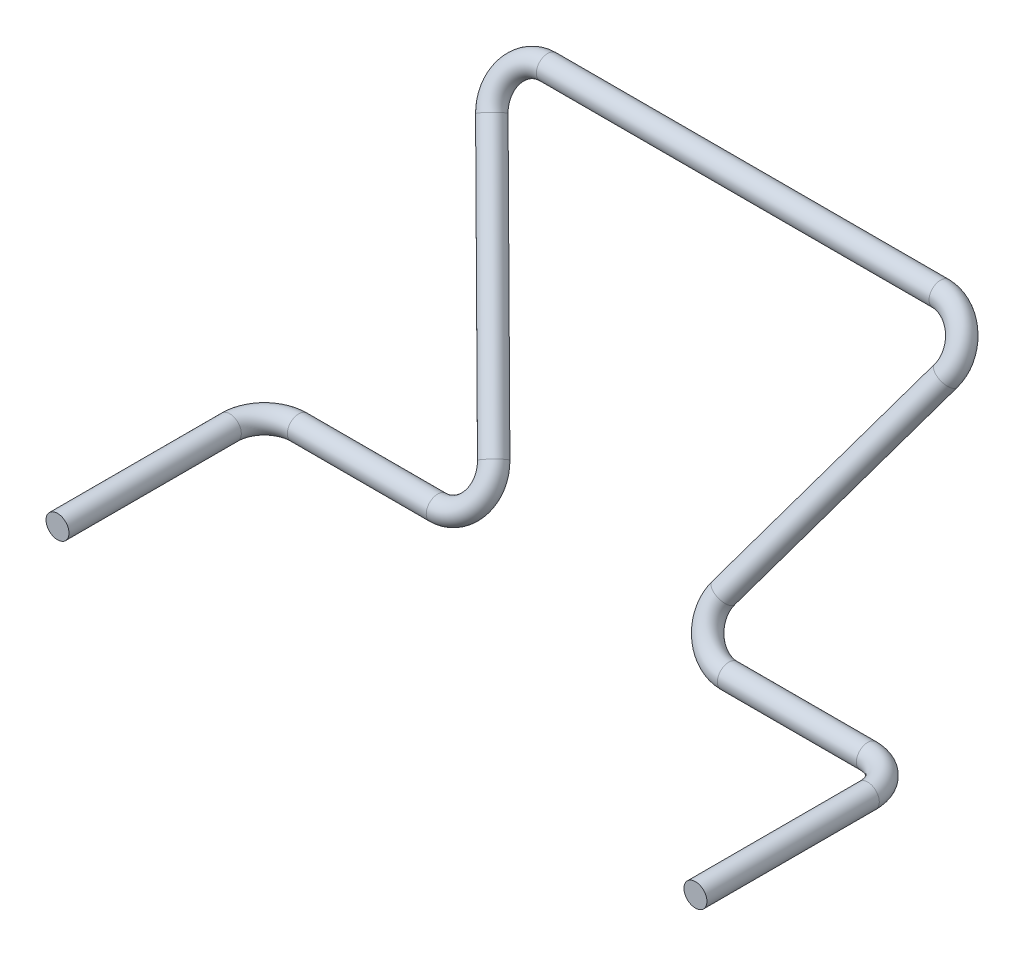
ISO-10303-21;
HEADER;
FILE_DESCRIPTION(('STEP AP214'),'2;1');
FILE_NAME('part.step','',(''),(''),'','','');
FILE_SCHEMA(('AUTOMOTIVE_DESIGN { 1 0 10303 214 1 1 1 1 }'));
ENDSEC;
DATA;
#1=APPLICATION_CONTEXT('core data for automotive mechanical design processes');
#2=APPLICATION_PROTOCOL_DEFINITION('international standard','automotive_design',2000,#1);
#3=PRODUCT_CONTEXT('',#1,'mechanical');
#4=PRODUCT('Part','Part','',(#3));
#5=PRODUCT_RELATED_PRODUCT_CATEGORY('part','',(#4));
#6=PRODUCT_DEFINITION_FORMATION('','',#4);
#7=PRODUCT_DEFINITION_CONTEXT('part definition',#1,'design');
#8=PRODUCT_DEFINITION('design','',#6,#7);
#9=PRODUCT_DEFINITION_SHAPE('','',#8);
#10=(LENGTH_UNIT() NAMED_UNIT(*) SI_UNIT(.MILLI.,.METRE.));
#11=(NAMED_UNIT(*) PLANE_ANGLE_UNIT() SI_UNIT($,.RADIAN.));
#12=(NAMED_UNIT(*) SI_UNIT($,.STERADIAN.) SOLID_ANGLE_UNIT());
#13=UNCERTAINTY_MEASURE_WITH_UNIT(LENGTH_MEASURE(1.E-05),#10,'distance_accuracy_value','');
#14=(GEOMETRIC_REPRESENTATION_CONTEXT(3) GLOBAL_UNCERTAINTY_ASSIGNED_CONTEXT((#13)) GLOBAL_UNIT_ASSIGNED_CONTEXT((#10,
#11,#12)) REPRESENTATION_CONTEXT('',''));
#15=CARTESIAN_POINT('',(0.,0.,0.));
#16=DIRECTION('',(0.,0.,1.));
#17=DIRECTION('',(1.,0.,0.));
#18=AXIS2_PLACEMENT_3D('',#15,#16,#17);
#19=CARTESIAN_POINT('',(-27.761508308363,0.,18.));
#20=DIRECTION('',(0.,0.,1.));
#21=DIRECTION('',(0.,-1.,0.));
#22=AXIS2_PLACEMENT_3D('',#19,#20,#21);
#23=PLANE('',#22);
#24=CARTESIAN_POINT('',(-27.761508308363,0.,18.));
#25=DIRECTION('',(0.,0.,1.));
#26=DIRECTION('',(0.,-1.,0.));
#27=AXIS2_PLACEMENT_3D('',#24,#25,#26);
#28=CIRCLE('',#27,0.999999999999999);
#29=CARTESIAN_POINT('',(-27.761508308363,-0.999999999999999,18.));
#30=VERTEX_POINT('',#29);
#31=EDGE_CURVE('E84',#30,#30,#28,.T.);
#32=ORIENTED_EDGE('',*,*,#31,.T.);
#33=EDGE_LOOP('',(#32));
#34=FACE_BOUND('',#33,.T.);
#35=ADVANCED_FACE('F59',(#34),#23,.T.);
#36=CARTESIAN_POINT('',(-27.761508308363,0.,18.));
#37=DIRECTION('',(0.,0.,-1.));
#38=DIRECTION('',(0.,1.,0.));
#39=AXIS2_PLACEMENT_3D('',#36,#37,#38);
#40=CYLINDRICAL_SURFACE('',#39,0.999999999999999);
#41=CARTESIAN_POINT('',(-27.761508308363,0.,3.));
#42=DIRECTION('',(0.,0.,1.));
#43=DIRECTION('',(0.,-1.,0.));
#44=AXIS2_PLACEMENT_3D('',#41,#42,#43);
#45=CIRCLE('',#44,0.999999999999999);
#46=CARTESIAN_POINT('',(-28.761508308363,0.,3.));
#47=VERTEX_POINT('',#46);
#48=EDGE_CURVE('E81',#47,#47,#45,.T.);
#49=ORIENTED_EDGE('',*,*,#48,.T.);
#50=EDGE_LOOP('',(#49));
#51=FACE_BOUND('',#50,.T.);
#52=ORIENTED_EDGE('',*,*,#31,.F.);
#53=EDGE_LOOP('',(#52));
#54=FACE_BOUND('',#53,.T.);
#55=ADVANCED_FACE('F148',(#51,#54),#40,.T.);
#56=CARTESIAN_POINT('',(-24.761508308363,0.,3.));
#57=DIRECTION('',(0.,-1.,0.));
#58=DIRECTION('',(0.,0.,-1.));
#59=AXIS2_PLACEMENT_3D('',#56,#57,#58);
#60=TOROIDAL_SURFACE('',#59,3.,0.999999999999999);
#61=CARTESIAN_POINT('',(-24.761508308363,0.,0.));
#62=DIRECTION('',(-1.,0.,0.));
#63=DIRECTION('',(0.,-1.,0.));
#64=AXIS2_PLACEMENT_3D('',#61,#62,#63);
#65=CIRCLE('',#64,0.999999999999999);
#66=CARTESIAN_POINT('',(-24.761508308363,0.,-1.));
#67=VERTEX_POINT('',#66);
#68=EDGE_CURVE('E78',#67,#67,#65,.T.);
#69=CARTESIAN_POINT('',(-24.761508308363,0.,3.));
#70=DIRECTION('',(0.,-1.,0.));
#71=DIRECTION('',(0.,0.,-1.));
#72=AXIS2_PLACEMENT_3D('',#69,#70,#71);
#73=CIRCLE('',#72,4.);
#74=EDGE_CURVE('',#47,#67,#73,.T.);
#75=ORIENTED_EDGE('',*,*,#48,.F.);
#76=ORIENTED_EDGE('',*,*,#68,.T.);
#77=ORIENTED_EDGE('',*,*,#74,.T.);
#78=ORIENTED_EDGE('',*,*,#74,.F.);
#79=EDGE_LOOP('',(#75,#77,#76,#78));
#80=FACE_BOUND('',#79,.T.);
#81=ADVANCED_FACE('F144',(#80),#60,.T.);
#82=CARTESIAN_POINT('',(-24.7615083083629,0.,0.));
#83=DIRECTION('',(1.,0.,0.));
#84=DIRECTION('',(0.,0.,-1.));
#85=AXIS2_PLACEMENT_3D('',#82,#83,#84);
#86=CYLINDRICAL_SURFACE('',#85,0.999999999999999);
#87=CARTESIAN_POINT('',(-12.6698490249606,0.,0.));
#88=DIRECTION('',(-1.,0.,0.));
#89=DIRECTION('',(0.,-1.,0.));
#90=AXIS2_PLACEMENT_3D('',#87,#88,#89);
#91=CIRCLE('',#90,0.999999999999999);
#92=CARTESIAN_POINT('',(-12.6698490249606,-0.863778900898468,0.503871025524018));
#93=VERTEX_POINT('',#92);
#94=EDGE_CURVE('E73',#93,#93,#91,.T.);
#95=ORIENTED_EDGE('',*,*,#94,.T.);
#96=EDGE_LOOP('',(#95));
#97=FACE_BOUND('',#96,.T.);
#98=ORIENTED_EDGE('',*,*,#68,.F.);
#99=EDGE_LOOP('',(#98));
#100=FACE_BOUND('',#99,.T.);
#101=ADVANCED_FACE('F140',(#97,#100),#86,.T.);
#102=CARTESIAN_POINT('',(-12.6698490249606,2.59133670269526,-1.51161307657232));
#103=DIRECTION('',(0.,0.503871025524086,0.863778900898434));
#104=DIRECTION('',(0.,-0.863778900898434,0.503871025524086));
#105=AXIS2_PLACEMENT_3D('',#102,#103,#104);
#106=TOROIDAL_SURFACE('',#105,3.,0.999999999999999);
#107=CARTESIAN_POINT('',(-10.,3.77313845895936,-2.20099743439298));
#108=DIRECTION('',(0.456058741820331,-0.768719752115087,0.448419855400467));
#109=DIRECTION('',(0.768719752115086,0.0863857970058409,-0.63372504825341));
#110=AXIS2_PLACEMENT_3D('',#107,#108,#109);
#111=CIRCLE('',#110,0.999999999999999);
#112=CARTESIAN_POINT('',(-9.11005032501312,4.16707237771406,-2.43079222033319));
#113=VERTEX_POINT('',#112);
#114=EDGE_CURVE('E69',#113,#113,#111,.T.);
#115=CARTESIAN_POINT('',(-12.6698490249606,2.59133670269526,-1.51161307657232));
#116=DIRECTION('',(0.,0.503871025524086,0.863778900898434));
#117=DIRECTION('',(0.,-0.863778900898434,0.503871025524086));
#118=AXIS2_PLACEMENT_3D('',#115,#116,#117);
#119=CIRCLE('',#118,4.);
#120=EDGE_CURVE('',#93,#113,#119,.T.);
#121=ORIENTED_EDGE('',*,*,#94,.F.);
#122=ORIENTED_EDGE('',*,*,#114,.T.);
#123=ORIENTED_EDGE('',*,*,#120,.T.);
#124=ORIENTED_EDGE('',*,*,#120,.F.);
#125=EDGE_LOOP('',(#121,#123,#122,#124));
#126=FACE_BOUND('',#125,.T.);
#127=ADVANCED_FACE('F137',(#126),#106,.T.);
#128=CARTESIAN_POINT('',(-10.,3.77313845895936,-2.20099743439298));
#129=DIRECTION('',(-0.456058741820331,0.768719752115088,-0.448419855400466));
#130=DIRECTION('',(-0.860035728115782,-0.510233815386982,0.));
#131=AXIS2_PLACEMENT_3D('',#128,#129,#130);
#132=CYLINDRICAL_SURFACE('',#131,0.999999999999999);
#133=CARTESIAN_POINT('',(-19.7615083083629,20.2268615410407,-11.799002565607));
#134=DIRECTION('',(0.45605874182033,-0.768719752115088,0.448419855400466));
#135=DIRECTION('',(0.768719752115086,0.0863857970058413,-0.63372504825341));
#136=AXIS2_PLACEMENT_3D('',#133,#134,#135);
#137=CIRCLE('',#136,0.999999999999999);
#138=CARTESIAN_POINT('',(-20.6514579833498,19.832927622286,-11.5692077796668));
#139=VERTEX_POINT('',#138);
#140=EDGE_CURVE('E65',#139,#139,#137,.T.);
#141=ORIENTED_EDGE('',*,*,#140,.T.);
#142=EDGE_LOOP('',(#141));
#143=FACE_BOUND('',#142,.T.);
#144=ORIENTED_EDGE('',*,*,#114,.F.);
#145=EDGE_LOOP('',(#144));
#146=FACE_BOUND('',#145,.T.);
#147=ADVANCED_FACE('F131',(#143,#146),#132,.T.);
#148=CARTESIAN_POINT('',(-17.0916592834023,21.4086632973047,-12.4883869234278));
#149=DIRECTION('',(0.,-0.503871025524087,-0.863778900898433));
#150=DIRECTION('',(0.,0.863778900898433,-0.503871025524087));
#151=AXIS2_PLACEMENT_3D('',#148,#149,#150);
#152=TOROIDAL_SURFACE('',#151,3.,0.999999999999999);
#153=CARTESIAN_POINT('',(-17.0916592834023,24.,-14.));
#154=DIRECTION('',(-1.,0.,0.));
#155=DIRECTION('',(0.,-1.,0.));
#156=AXIS2_PLACEMENT_3D('',#153,#154,#155);
#157=CIRCLE('',#156,0.999999999999999);
#158=CARTESIAN_POINT('',(-17.0916592834023,24.8637789008984,-14.5038710255241));
#159=VERTEX_POINT('',#158);
#160=EDGE_CURVE('E11',#159,#159,#157,.T.);
#161=CARTESIAN_POINT('',(-17.0916592834023,21.4086632973047,-12.4883869234278));
#162=DIRECTION('',(0.,-0.503871025524087,-0.863778900898433));
#163=DIRECTION('',(0.,0.863778900898433,-0.503871025524087));
#164=AXIS2_PLACEMENT_3D('',#161,#162,#163);
#165=CIRCLE('',#164,4.);
#166=EDGE_CURVE('',#139,#159,#165,.T.);
#167=ORIENTED_EDGE('',*,*,#140,.F.);
#168=ORIENTED_EDGE('',*,*,#160,.T.);
#169=ORIENTED_EDGE('',*,*,#166,.T.);
#170=ORIENTED_EDGE('',*,*,#166,.F.);
#171=EDGE_LOOP('',(#167,#169,#168,#170));
#172=FACE_BOUND('',#171,.T.);
#173=ADVANCED_FACE('F126',(#172),#152,.T.);
#174=CARTESIAN_POINT('',(-17.0916592834023,24.,-14.));
#175=DIRECTION('',(1.,0.,0.));
#176=DIRECTION('',(0.,0.,-1.));
#177=AXIS2_PLACEMENT_3D('',#174,#175,#176);
#178=CYLINDRICAL_SURFACE('',#177,0.999999999999999);
#179=ORIENTED_EDGE('',*,*,#160,.F.);
#180=EDGE_LOOP('',(#179));
#181=FACE_BOUND('',#180,.T.);
#182=CARTESIAN_POINT('',(17.0916592834023,24.,-14.));
#183=DIRECTION('',(-1.,0.,0.));
#184=DIRECTION('',(0.,-1.,0.));
#185=AXIS2_PLACEMENT_3D('',#182,#183,#184);
#186=CIRCLE('',#185,0.999999999999999);
#187=CARTESIAN_POINT('',(17.0916592834023,24.8637789008984,-14.5038710255241));
#188=VERTEX_POINT('',#187);
#189=EDGE_CURVE('E87',#188,#188,#186,.F.);
#190=ORIENTED_EDGE('',*,*,#189,.F.);
#191=EDGE_LOOP('',(#190));
#192=FACE_BOUND('',#191,.T.);
#193=ADVANCED_FACE('F123',(#181,#192),#178,.T.);
#194=CARTESIAN_POINT('',(27.761508308363,0.,18.));
#195=DIRECTION('',(0.,0.,1.));
#196=DIRECTION('',(0.,-1.,0.));
#197=AXIS2_PLACEMENT_3D('',#194,#195,#196);
#198=PLANE('',#197);
#199=CARTESIAN_POINT('',(27.761508308363,0.,18.));
#200=DIRECTION('',(0.,0.,-1.));
#201=DIRECTION('',(0.,-1.,0.));
#202=AXIS2_PLACEMENT_3D('',#199,#200,#201);
#203=CIRCLE('',#202,0.999999999999999);
#204=CARTESIAN_POINT('',(27.761508308363,-0.999999999999999,18.));
#205=VERTEX_POINT('',#204);
#206=EDGE_CURVE('E105',#205,#205,#203,.F.);
#207=ORIENTED_EDGE('',*,*,#206,.T.);
#208=EDGE_LOOP('',(#207));
#209=FACE_BOUND('',#208,.T.);
#210=ADVANCED_FACE('F109',(#209),#198,.T.);
#211=CARTESIAN_POINT('',(27.761508308363,0.,18.));
#212=DIRECTION('',(0.,0.,-1.));
#213=DIRECTION('',(0.,1.,0.));
#214=AXIS2_PLACEMENT_3D('',#211,#212,#213);
#215=CYLINDRICAL_SURFACE('',#214,0.999999999999999);
#216=CARTESIAN_POINT('',(27.761508308363,0.,3.));
#217=DIRECTION('',(0.,0.,-1.));
#218=DIRECTION('',(0.,-1.,0.));
#219=AXIS2_PLACEMENT_3D('',#216,#217,#218);
#220=CIRCLE('',#219,0.999999999999999);
#221=CARTESIAN_POINT('',(28.761508308363,0.,3.));
#222=VERTEX_POINT('',#221);
#223=EDGE_CURVE('E102',#222,#222,#220,.F.);
#224=ORIENTED_EDGE('',*,*,#223,.T.);
#225=EDGE_LOOP('',(#224));
#226=FACE_BOUND('',#225,.T.);
#227=ORIENTED_EDGE('',*,*,#206,.F.);
#228=EDGE_LOOP('',(#227));
#229=FACE_BOUND('',#228,.T.);
#230=ADVANCED_FACE('F111',(#226,#229),#215,.T.);
#231=CARTESIAN_POINT('',(24.761508308363,0.,3.));
#232=DIRECTION('',(0.,1.,0.));
#233=DIRECTION('',(0.,0.,1.));
#234=AXIS2_PLACEMENT_3D('',#231,#232,#233);
#235=TOROIDAL_SURFACE('',#234,3.,0.999999999999999);
#236=CARTESIAN_POINT('',(24.761508308363,0.,0.));
#237=DIRECTION('',(-1.,0.,0.));
#238=DIRECTION('',(0.,-1.,0.));
#239=AXIS2_PLACEMENT_3D('',#236,#237,#238);
#240=CIRCLE('',#239,0.999999999999999);
#241=CARTESIAN_POINT('',(24.761508308363,0.,-1.));
#242=VERTEX_POINT('',#241);
#243=EDGE_CURVE('E99',#242,#242,#240,.F.);
#244=CARTESIAN_POINT('',(24.761508308363,0.,3.));
#245=DIRECTION('',(0.,1.,0.));
#246=DIRECTION('',(0.,0.,1.));
#247=AXIS2_PLACEMENT_3D('',#244,#245,#246);
#248=CIRCLE('',#247,4.);
#249=EDGE_CURVE('',#222,#242,#248,.T.);
#250=ORIENTED_EDGE('',*,*,#223,.F.);
#251=ORIENTED_EDGE('',*,*,#243,.T.);
#252=ORIENTED_EDGE('',*,*,#249,.T.);
#253=ORIENTED_EDGE('',*,*,#249,.F.);
#254=EDGE_LOOP('',(#250,#252,#251,#253));
#255=FACE_BOUND('',#254,.T.);
#256=ADVANCED_FACE('F113',(#255),#235,.T.);
#257=CARTESIAN_POINT('',(24.7615083083629,0.,0.));
#258=DIRECTION('',(-1.,0.,0.));
#259=DIRECTION('',(0.,0.,1.));
#260=AXIS2_PLACEMENT_3D('',#257,#258,#259);
#261=CYLINDRICAL_SURFACE('',#260,0.999999999999999);
#262=CARTESIAN_POINT('',(12.6698490249606,0.,0.));
#263=DIRECTION('',(-1.,0.,0.));
#264=DIRECTION('',(0.,-1.,0.));
#265=AXIS2_PLACEMENT_3D('',#262,#263,#264);
#266=CIRCLE('',#265,0.999999999999999);
#267=CARTESIAN_POINT('',(12.6698490249606,-0.863778900898468,0.503871025524018));
#268=VERTEX_POINT('',#267);
#269=EDGE_CURVE('E96',#268,#268,#266,.F.);
#270=ORIENTED_EDGE('',*,*,#269,.T.);
#271=EDGE_LOOP('',(#270));
#272=FACE_BOUND('',#271,.T.);
#273=ORIENTED_EDGE('',*,*,#243,.F.);
#274=EDGE_LOOP('',(#273));
#275=FACE_BOUND('',#274,.T.);
#276=ADVANCED_FACE('F120',(#272,#275),#261,.T.);
#277=CARTESIAN_POINT('',(12.6698490249606,2.59133670269526,-1.51161307657232));
#278=DIRECTION('',(0.,-0.503871025524086,-0.863778900898434));
#279=DIRECTION('',(0.,0.863778900898434,-0.503871025524086));
#280=AXIS2_PLACEMENT_3D('',#277,#278,#279);
#281=TOROIDAL_SURFACE('',#280,3.,0.999999999999999);
#282=CARTESIAN_POINT('',(10.,3.77313845895936,-2.20099743439298));
#283=DIRECTION('',(0.456058741820331,0.768719752115087,-0.448419855400467));
#284=DIRECTION('',(-0.768719752115086,0.0863857970058409,-0.63372504825341));
#285=AXIS2_PLACEMENT_3D('',#282,#283,#284);
#286=CIRCLE('',#285,0.999999999999999);
#287=CARTESIAN_POINT('',(9.11005032501312,4.16707237771406,-2.43079222033319));
#288=VERTEX_POINT('',#287);
#289=EDGE_CURVE('E93',#288,#288,#286,.F.);
#290=CARTESIAN_POINT('',(12.6698490249606,2.59133670269526,-1.51161307657232));
#291=DIRECTION('',(0.,-0.503871025524086,-0.863778900898434));
#292=DIRECTION('',(0.,0.863778900898434,-0.503871025524086));
#293=AXIS2_PLACEMENT_3D('',#290,#291,#292);
#294=CIRCLE('',#293,4.);
#295=EDGE_CURVE('',#268,#288,#294,.T.);
#296=ORIENTED_EDGE('',*,*,#269,.F.);
#297=ORIENTED_EDGE('',*,*,#289,.T.);
#298=ORIENTED_EDGE('',*,*,#295,.T.);
#299=ORIENTED_EDGE('',*,*,#295,.F.);
#300=EDGE_LOOP('',(#296,#298,#297,#299));
#301=FACE_BOUND('',#300,.T.);
#302=ADVANCED_FACE('F160',(#301),#281,.T.);
#303=CARTESIAN_POINT('',(10.,3.77313845895936,-2.20099743439298));
#304=DIRECTION('',(0.456058741820331,0.768719752115088,-0.448419855400466));
#305=DIRECTION('',(-0.860035728115782,0.510233815386982,0.));
#306=AXIS2_PLACEMENT_3D('',#303,#304,#305);
#307=CYLINDRICAL_SURFACE('',#306,0.999999999999999);
#308=CARTESIAN_POINT('',(19.7615083083629,20.2268615410407,-11.799002565607));
#309=DIRECTION('',(0.45605874182033,0.768719752115088,-0.448419855400466));
#310=DIRECTION('',(-0.768719752115086,0.0863857970058413,-0.63372504825341));
#311=AXIS2_PLACEMENT_3D('',#308,#309,#310);
#312=CIRCLE('',#311,0.999999999999999);
#313=CARTESIAN_POINT('',(20.6514579833498,19.832927622286,-11.5692077796668));
#314=VERTEX_POINT('',#313);
#315=EDGE_CURVE('E90',#314,#314,#312,.F.);
#316=ORIENTED_EDGE('',*,*,#315,.T.);
#317=EDGE_LOOP('',(#316));
#318=FACE_BOUND('',#317,.T.);
#319=ORIENTED_EDGE('',*,*,#289,.F.);
#320=EDGE_LOOP('',(#319));
#321=FACE_BOUND('',#320,.T.);
#322=ADVANCED_FACE('F156',(#318,#321),#307,.T.);
#323=CARTESIAN_POINT('',(17.0916592834023,21.4086632973047,-12.4883869234278));
#324=DIRECTION('',(0.,0.503871025524087,0.863778900898433));
#325=DIRECTION('',(0.,-0.863778900898433,0.503871025524087));
#326=AXIS2_PLACEMENT_3D('',#323,#324,#325);
#327=TOROIDAL_SURFACE('',#326,3.,0.999999999999999);
#328=CARTESIAN_POINT('',(17.0916592834023,21.4086632973047,-12.4883869234278));
#329=DIRECTION('',(0.,0.503871025524087,0.863778900898433));
#330=DIRECTION('',(0.,-0.863778900898433,0.503871025524087));
#331=AXIS2_PLACEMENT_3D('',#328,#329,#330);
#332=CIRCLE('',#331,4.);
#333=EDGE_CURVE('',#314,#188,#332,.T.);
#334=ORIENTED_EDGE('',*,*,#315,.F.);
#335=ORIENTED_EDGE('',*,*,#189,.T.);
#336=ORIENTED_EDGE('',*,*,#333,.T.);
#337=ORIENTED_EDGE('',*,*,#333,.F.);
#338=EDGE_LOOP('',(#334,#336,#335,#337));
#339=FACE_BOUND('',#338,.T.);
#340=ADVANCED_FACE('F153',(#339),#327,.T.);
#341=CLOSED_SHELL('',(#35,#55,#81,#101,#127,#147,#173,#193,#210,#230,#256,#276,#302,#322,#340));
#342=MANIFOLD_SOLID_BREP('B2',#341);
#343=ADVANCED_BREP_SHAPE_REPRESENTATION('',(#18,#342),#14);
#344=SHAPE_DEFINITION_REPRESENTATION(#9,#343);
ENDSEC;
END-ISO-10303-21;
